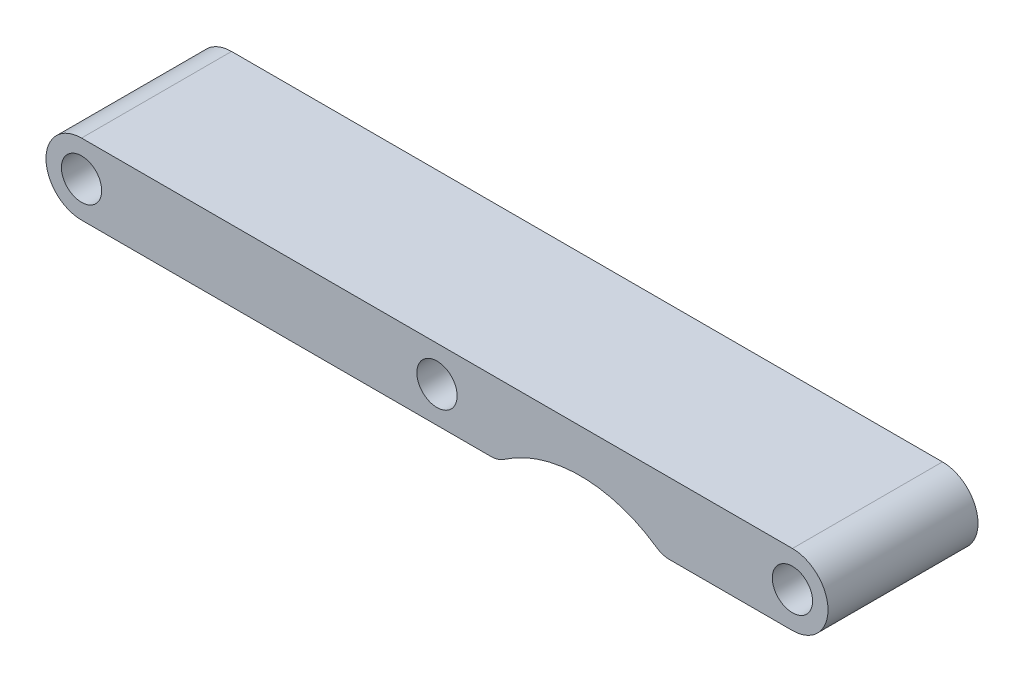
ISO-10303-21;
HEADER;
FILE_DESCRIPTION(('STEP AP214'),'2;1');
FILE_NAME('part.step','',(''),(''),'','','');
FILE_SCHEMA(('AUTOMOTIVE_DESIGN { 1 0 10303 214 1 1 1 1 }'));
ENDSEC;
DATA;
#1=APPLICATION_CONTEXT('core data for automotive mechanical design processes');
#2=APPLICATION_PROTOCOL_DEFINITION('international standard','automotive_design',2000,#1);
#3=PRODUCT_CONTEXT('',#1,'mechanical');
#4=PRODUCT('Part','Part','',(#3));
#5=PRODUCT_RELATED_PRODUCT_CATEGORY('part','',(#4));
#6=PRODUCT_DEFINITION_FORMATION('','',#4);
#7=PRODUCT_DEFINITION_CONTEXT('part definition',#1,'design');
#8=PRODUCT_DEFINITION('design','',#6,#7);
#9=PRODUCT_DEFINITION_SHAPE('','',#8);
#10=(LENGTH_UNIT() NAMED_UNIT(*) SI_UNIT(.MILLI.,.METRE.));
#11=(NAMED_UNIT(*) PLANE_ANGLE_UNIT() SI_UNIT($,.RADIAN.));
#12=(NAMED_UNIT(*) SI_UNIT($,.STERADIAN.) SOLID_ANGLE_UNIT());
#13=UNCERTAINTY_MEASURE_WITH_UNIT(LENGTH_MEASURE(1.E-05),#10,'distance_accuracy_value','');
#14=(GEOMETRIC_REPRESENTATION_CONTEXT(3) GLOBAL_UNCERTAINTY_ASSIGNED_CONTEXT((#13)) GLOBAL_UNIT_ASSIGNED_CONTEXT((#10,
#11,#12)) REPRESENTATION_CONTEXT('',''));
#15=CARTESIAN_POINT('',(0.,0.,0.));
#16=DIRECTION('',(0.,0.,1.));
#17=DIRECTION('',(1.,0.,0.));
#18=AXIS2_PLACEMENT_3D('',#15,#16,#17);
#19=CARTESIAN_POINT('',(76.2,3.81,16.0782));
#20=DIRECTION('',(0.,0.,-1.));
#21=DIRECTION('',(-1.,0.,0.));
#22=AXIS2_PLACEMENT_3D('',#19,#20,#21);
#23=PLANE('',#22);
#24=CARTESIAN_POINT('',(53.46050014,-11.28776,16.0782));
#25=DIRECTION('',(0.,0.,-1.));
#26=DIRECTION('',(-1.,0.,0.));
#27=AXIS2_PLACEMENT_3D('',#24,#25,#26);
#28=CIRCLE('',#27,14.2875);
#29=CARTESIAN_POINT('',(45.3185028545965,0.452790943396227,16.0782));
#30=VERTEX_POINT('',#29);
#31=CARTESIAN_POINT('',(61.6024974254035,0.452790943396231,16.0782));
#32=VERTEX_POINT('',#31);
#33=EDGE_CURVE('E143',#30,#32,#28,.T.);
#34=ORIENTED_EDGE('',*,*,#33,.T.);
#35=CARTESIAN_POINT('',(63.0499636094752,2.54,16.0782));
#36=DIRECTION('',(0.,0.,-1.));
#37=DIRECTION('',(-1.,0.,0.));
#38=AXIS2_PLACEMENT_3D('',#35,#36,#37);
#39=CIRCLE('',#38,2.54);
#40=CARTESIAN_POINT('',(63.0499636094752,0.,16.0782));
#41=VERTEX_POINT('',#40);
#42=EDGE_CURVE('E41',#32,#41,#39,.F.);
#43=ORIENTED_EDGE('',*,*,#42,.T.);
#44=DIRECTION('',(1.,0.,0.));
#45=VECTOR('',#44,1.);
#46=CARTESIAN_POINT('',(62.219445877496,0.,16.0782));
#47=LINE('',#46,#45);
#48=CARTESIAN_POINT('',(76.2,0.,16.0782));
#49=VERTEX_POINT('',#48);
#50=EDGE_CURVE('E116',#41,#49,#47,.T.);
#51=ORIENTED_EDGE('',*,*,#50,.T.);
#52=CARTESIAN_POINT('',(76.2,3.81,16.0782));
#53=DIRECTION('',(0.,0.,1.));
#54=DIRECTION('',(-1.,0.,0.));
#55=AXIS2_PLACEMENT_3D('',#52,#53,#54);
#56=CIRCLE('',#55,3.81);
#57=CARTESIAN_POINT('',(76.2,7.62000000000001,16.0782));
#58=VERTEX_POINT('',#57);
#59=EDGE_CURVE('E111',#49,#58,#56,.T.);
#60=ORIENTED_EDGE('',*,*,#59,.T.);
#61=DIRECTION('',(-1.,0.,0.));
#62=VECTOR('',#61,1.);
#63=CARTESIAN_POINT('',(0.,7.62,16.0782));
#64=LINE('',#63,#62);
#65=CARTESIAN_POINT('',(0.,7.62,16.0782));
#66=VERTEX_POINT('',#65);
#67=EDGE_CURVE('E100',#58,#66,#64,.T.);
#68=ORIENTED_EDGE('',*,*,#67,.T.);
#69=CARTESIAN_POINT('',(0.,3.81,16.0782));
#70=DIRECTION('',(0.,0.,1.));
#71=DIRECTION('',(1.,0.,0.));
#72=AXIS2_PLACEMENT_3D('',#69,#70,#71);
#73=CIRCLE('',#72,3.81);
#74=CARTESIAN_POINT('',(0.,0.,16.0782));
#75=VERTEX_POINT('',#74);
#76=EDGE_CURVE('E110',#66,#75,#73,.T.);
#77=ORIENTED_EDGE('',*,*,#76,.T.);
#78=DIRECTION('',(1.,0.,0.));
#79=VECTOR('',#78,1.);
#80=CARTESIAN_POINT('',(0.,0.,16.0782));
#81=LINE('',#80,#79);
#82=CARTESIAN_POINT('',(43.8710366705248,0.,16.0782));
#83=VERTEX_POINT('',#82);
#84=EDGE_CURVE('E170',#75,#83,#81,.T.);
#85=ORIENTED_EDGE('',*,*,#84,.T.);
#86=CARTESIAN_POINT('',(43.8710366705248,2.54,16.0782));
#87=DIRECTION('',(0.,0.,-1.));
#88=DIRECTION('',(-1.,0.,0.));
#89=AXIS2_PLACEMENT_3D('',#86,#87,#88);
#90=CIRCLE('',#89,2.54);
#91=EDGE_CURVE('E141',#83,#30,#90,.F.);
#92=ORIENTED_EDGE('',*,*,#91,.T.);
#93=EDGE_LOOP('',(#34,#43,#51,#60,#68,#77,#85,#92));
#94=FACE_BOUND('',#93,.T.);
#95=CARTESIAN_POINT('',(0.,3.81,16.0782));
#96=DIRECTION('',(0.,0.,1.));
#97=DIRECTION('',(1.,0.,0.));
#98=AXIS2_PLACEMENT_3D('',#95,#96,#97);
#99=CIRCLE('',#98,2.159);
#100=CARTESIAN_POINT('',(2.159,3.81,16.0782));
#101=VERTEX_POINT('',#100);
#102=EDGE_CURVE('E181',#101,#101,#99,.T.);
#103=ORIENTED_EDGE('',*,*,#102,.F.);
#104=EDGE_LOOP('',(#103));
#105=FACE_BOUND('',#104,.T.);
#106=CARTESIAN_POINT('',(38.1,3.81,16.0782));
#107=DIRECTION('',(0.,0.,1.));
#108=DIRECTION('',(1.,0.,0.));
#109=AXIS2_PLACEMENT_3D('',#106,#107,#108);
#110=CIRCLE('',#109,2.159);
#111=CARTESIAN_POINT('',(40.259,3.81,16.0782));
#112=VERTEX_POINT('',#111);
#113=EDGE_CURVE('E187',#112,#112,#110,.T.);
#114=ORIENTED_EDGE('',*,*,#113,.F.);
#115=EDGE_LOOP('',(#114));
#116=FACE_BOUND('',#115,.T.);
#117=CARTESIAN_POINT('',(76.2,3.81,16.0782));
#118=DIRECTION('',(0.,0.,1.));
#119=DIRECTION('',(1.,0.,0.));
#120=AXIS2_PLACEMENT_3D('',#117,#118,#119);
#121=CIRCLE('',#120,2.15899999999999);
#122=CARTESIAN_POINT('',(78.359,3.81,16.0782));
#123=VERTEX_POINT('',#122);
#124=EDGE_CURVE('E193',#123,#123,#121,.T.);
#125=ORIENTED_EDGE('',*,*,#124,.F.);
#126=EDGE_LOOP('',(#125));
#127=FACE_BOUND('',#126,.T.);
#128=ADVANCED_FACE('F33',(#94,#105,#116,#127),#23,.F.);
#129=CARTESIAN_POINT('',(76.2,3.81,0.));
#130=DIRECTION('',(0.,0.,-1.));
#131=DIRECTION('',(-1.,0.,0.));
#132=AXIS2_PLACEMENT_3D('',#129,#130,#131);
#133=PLANE('',#132);
#134=CARTESIAN_POINT('',(38.1,3.81,0.));
#135=DIRECTION('',(0.,0.,1.));
#136=DIRECTION('',(1.,0.,0.));
#137=AXIS2_PLACEMENT_3D('',#134,#135,#136);
#138=CIRCLE('',#137,2.159);
#139=CARTESIAN_POINT('',(40.259,3.81,0.));
#140=VERTEX_POINT('',#139);
#141=EDGE_CURVE('E190',#140,#140,#138,.T.);
#142=ORIENTED_EDGE('',*,*,#141,.T.);
#143=EDGE_LOOP('',(#142));
#144=FACE_BOUND('',#143,.T.);
#145=DIRECTION('',(1.,0.,0.));
#146=VECTOR('',#145,1.);
#147=CARTESIAN_POINT('',(62.219445877496,0.,0.));
#148=LINE('',#147,#146);
#149=CARTESIAN_POINT('',(63.0499636094752,0.,0.));
#150=VERTEX_POINT('',#149);
#151=CARTESIAN_POINT('',(76.2,0.,0.));
#152=VERTEX_POINT('',#151);
#153=EDGE_CURVE('E120',#150,#152,#148,.T.);
#154=ORIENTED_EDGE('',*,*,#153,.F.);
#155=CARTESIAN_POINT('',(63.0499636094752,2.54,0.));
#156=DIRECTION('',(0.,0.,-1.));
#157=DIRECTION('',(-1.,0.,0.));
#158=AXIS2_PLACEMENT_3D('',#155,#156,#157);
#159=CIRCLE('',#158,2.54);
#160=CARTESIAN_POINT('',(61.6024974254035,0.452790943396231,0.));
#161=VERTEX_POINT('',#160);
#162=EDGE_CURVE('E135',#150,#161,#159,.T.);
#163=ORIENTED_EDGE('',*,*,#162,.T.);
#164=CARTESIAN_POINT('',(53.46050014,-11.28776,0.));
#165=DIRECTION('',(0.,0.,-1.));
#166=DIRECTION('',(-1.,0.,0.));
#167=AXIS2_PLACEMENT_3D('',#164,#165,#166);
#168=CIRCLE('',#167,14.2875);
#169=CARTESIAN_POINT('',(45.3185028545965,0.452790943396227,0.));
#170=VERTEX_POINT('',#169);
#171=EDGE_CURVE('E156',#170,#161,#168,.T.);
#172=ORIENTED_EDGE('',*,*,#171,.F.);
#173=CARTESIAN_POINT('',(43.8710366705248,2.54,0.));
#174=DIRECTION('',(0.,0.,-1.));
#175=DIRECTION('',(-1.,0.,0.));
#176=AXIS2_PLACEMENT_3D('',#173,#174,#175);
#177=CIRCLE('',#176,2.54);
#178=CARTESIAN_POINT('',(43.8710366705248,0.,0.));
#179=VERTEX_POINT('',#178);
#180=EDGE_CURVE('E128',#170,#179,#177,.T.);
#181=ORIENTED_EDGE('',*,*,#180,.T.);
#182=DIRECTION('',(1.,0.,0.));
#183=VECTOR('',#182,1.);
#184=CARTESIAN_POINT('',(0.,0.,0.));
#185=LINE('',#184,#183);
#186=CARTESIAN_POINT('',(0.,0.,0.));
#187=VERTEX_POINT('',#186);
#188=EDGE_CURVE('E159',#187,#179,#185,.T.);
#189=ORIENTED_EDGE('',*,*,#188,.F.);
#190=CARTESIAN_POINT('',(0.,3.81,0.));
#191=DIRECTION('',(0.,0.,1.));
#192=DIRECTION('',(1.,0.,0.));
#193=AXIS2_PLACEMENT_3D('',#190,#191,#192);
#194=CIRCLE('',#193,3.81);
#195=CARTESIAN_POINT('',(0.,7.62,0.));
#196=VERTEX_POINT('',#195);
#197=EDGE_CURVE('E162',#196,#187,#194,.T.);
#198=ORIENTED_EDGE('',*,*,#197,.F.);
#199=DIRECTION('',(-1.,0.,0.));
#200=VECTOR('',#199,1.);
#201=CARTESIAN_POINT('',(0.,7.62,0.));
#202=LINE('',#201,#200);
#203=CARTESIAN_POINT('',(76.2,7.62000000000001,0.));
#204=VERTEX_POINT('',#203);
#205=EDGE_CURVE('E180',#204,#196,#202,.T.);
#206=ORIENTED_EDGE('',*,*,#205,.F.);
#207=CARTESIAN_POINT('',(76.2,3.81,0.));
#208=DIRECTION('',(0.,0.,1.));
#209=DIRECTION('',(-1.,0.,0.));
#210=AXIS2_PLACEMENT_3D('',#207,#208,#209);
#211=CIRCLE('',#210,3.81);
#212=EDGE_CURVE('E124',#152,#204,#211,.T.);
#213=ORIENTED_EDGE('',*,*,#212,.F.);
#214=EDGE_LOOP('',(#154,#163,#172,#181,#189,#198,#206,#213));
#215=FACE_BOUND('',#214,.T.);
#216=CARTESIAN_POINT('',(0.,3.81,0.));
#217=DIRECTION('',(0.,0.,1.));
#218=DIRECTION('',(1.,0.,0.));
#219=AXIS2_PLACEMENT_3D('',#216,#217,#218);
#220=CIRCLE('',#219,2.159);
#221=CARTESIAN_POINT('',(2.159,3.81,0.));
#222=VERTEX_POINT('',#221);
#223=EDGE_CURVE('E184',#222,#222,#220,.T.);
#224=ORIENTED_EDGE('',*,*,#223,.T.);
#225=EDGE_LOOP('',(#224));
#226=FACE_BOUND('',#225,.T.);
#227=CARTESIAN_POINT('',(76.2,3.81,0.));
#228=DIRECTION('',(0.,0.,1.));
#229=DIRECTION('',(1.,0.,0.));
#230=AXIS2_PLACEMENT_3D('',#227,#228,#229);
#231=CIRCLE('',#230,2.15899999999999);
#232=CARTESIAN_POINT('',(78.359,3.81,0.));
#233=VERTEX_POINT('',#232);
#234=EDGE_CURVE('E196',#233,#233,#231,.T.);
#235=ORIENTED_EDGE('',*,*,#234,.T.);
#236=EDGE_LOOP('',(#235));
#237=FACE_BOUND('',#236,.T.);
#238=ADVANCED_FACE('F154',(#144,#215,#226,#237),#133,.T.);
#239=CARTESIAN_POINT('',(76.2,3.81,16.0782));
#240=DIRECTION('',(0.,0.,-1.));
#241=DIRECTION('',(-1.,0.,0.));
#242=AXIS2_PLACEMENT_3D('',#239,#240,#241);
#243=CYLINDRICAL_SURFACE('',#242,3.81);
#244=ORIENTED_EDGE('',*,*,#212,.T.);
#245=DIRECTION('',(0.,0.,-1.));
#246=VECTOR('',#245,1.);
#247=CARTESIAN_POINT('',(76.2,7.62000000000001,16.0782));
#248=LINE('',#247,#246);
#249=EDGE_CURVE('E104',#58,#204,#248,.T.);
#250=ORIENTED_EDGE('',*,*,#249,.F.);
#251=ORIENTED_EDGE('',*,*,#59,.F.);
#252=DIRECTION('',(0.,0.,-1.));
#253=VECTOR('',#252,1.);
#254=CARTESIAN_POINT('',(76.2,0.,16.0782));
#255=LINE('',#254,#253);
#256=EDGE_CURVE('E149',#49,#152,#255,.T.);
#257=ORIENTED_EDGE('',*,*,#256,.T.);
#258=EDGE_LOOP('',(#244,#250,#251,#257));
#259=FACE_BOUND('',#258,.T.);
#260=ADVANCED_FACE('F122',(#259),#243,.T.);
#261=CARTESIAN_POINT('',(0.,7.62,16.0782));
#262=DIRECTION('',(0.,-1.,0.));
#263=DIRECTION('',(1.,0.,0.));
#264=AXIS2_PLACEMENT_3D('',#261,#262,#263);
#265=PLANE('',#264);
#266=ORIENTED_EDGE('',*,*,#205,.T.);
#267=DIRECTION('',(0.,0.,-1.));
#268=VECTOR('',#267,1.);
#269=CARTESIAN_POINT('',(0.,7.62,16.0782));
#270=LINE('',#269,#268);
#271=EDGE_CURVE('E107',#66,#196,#270,.T.);
#272=ORIENTED_EDGE('',*,*,#271,.F.);
#273=ORIENTED_EDGE('',*,*,#67,.F.);
#274=ORIENTED_EDGE('',*,*,#249,.T.);
#275=EDGE_LOOP('',(#266,#272,#273,#274));
#276=FACE_BOUND('',#275,.T.);
#277=ADVANCED_FACE('F102',(#276),#265,.F.);
#278=CARTESIAN_POINT('',(0.,3.81,16.0782));
#279=DIRECTION('',(0.,0.,-1.));
#280=DIRECTION('',(-1.,0.,0.));
#281=AXIS2_PLACEMENT_3D('',#278,#279,#280);
#282=CYLINDRICAL_SURFACE('',#281,3.81);
#283=ORIENTED_EDGE('',*,*,#197,.T.);
#284=DIRECTION('',(0.,0.,-1.));
#285=VECTOR('',#284,1.);
#286=CARTESIAN_POINT('',(0.,0.,16.0782));
#287=LINE('',#286,#285);
#288=EDGE_CURVE('E130',#75,#187,#287,.T.);
#289=ORIENTED_EDGE('',*,*,#288,.F.);
#290=ORIENTED_EDGE('',*,*,#76,.F.);
#291=ORIENTED_EDGE('',*,*,#271,.T.);
#292=EDGE_LOOP('',(#283,#289,#290,#291));
#293=FACE_BOUND('',#292,.T.);
#294=ADVANCED_FACE('F182',(#293),#282,.T.);
#295=CARTESIAN_POINT('',(0.,0.,16.0782));
#296=DIRECTION('',(0.,1.,0.));
#297=DIRECTION('',(0.,0.,1.));
#298=AXIS2_PLACEMENT_3D('',#295,#296,#297);
#299=PLANE('',#298);
#300=ORIENTED_EDGE('',*,*,#188,.T.);
#301=DIRECTION('',(0.,0.,-1.));
#302=VECTOR('',#301,1.);
#303=CARTESIAN_POINT('',(43.8710366705248,0.,16.0782));
#304=LINE('',#303,#302);
#305=EDGE_CURVE('E11',#179,#83,#304,.F.);
#306=ORIENTED_EDGE('',*,*,#305,.T.);
#307=ORIENTED_EDGE('',*,*,#84,.F.);
#308=ORIENTED_EDGE('',*,*,#288,.T.);
#309=EDGE_LOOP('',(#300,#306,#307,#308));
#310=FACE_BOUND('',#309,.T.);
#311=ADVANCED_FACE('F169',(#310),#299,.F.);
#312=CARTESIAN_POINT('',(53.46050014,-11.28776,16.0782));
#313=DIRECTION('',(0.,0.,-1.));
#314=DIRECTION('',(-1.,0.,0.));
#315=AXIS2_PLACEMENT_3D('',#312,#313,#314);
#316=CYLINDRICAL_SURFACE('',#315,14.2875);
#317=ORIENTED_EDGE('',*,*,#171,.T.);
#318=DIRECTION('',(0.,0.,-1.));
#319=VECTOR('',#318,1.);
#320=CARTESIAN_POINT('',(61.6024974254035,0.452790943396232,16.0782));
#321=LINE('',#320,#319);
#322=EDGE_CURVE('E54',#161,#32,#321,.F.);
#323=ORIENTED_EDGE('',*,*,#322,.T.);
#324=ORIENTED_EDGE('',*,*,#33,.F.);
#325=DIRECTION('',(0.,0.,-1.));
#326=VECTOR('',#325,1.);
#327=CARTESIAN_POINT('',(45.3185028545965,0.452790943396227,16.0782));
#328=LINE('',#327,#326);
#329=EDGE_CURVE('E137',#30,#170,#328,.T.);
#330=ORIENTED_EDGE('',*,*,#329,.T.);
#331=EDGE_LOOP('',(#317,#323,#324,#330));
#332=FACE_BOUND('',#331,.T.);
#333=ADVANCED_FACE('F157',(#332),#316,.F.);
#334=CARTESIAN_POINT('',(62.219445877496,0.,16.0782));
#335=DIRECTION('',(0.,1.,0.));
#336=DIRECTION('',(0.,0.,1.));
#337=AXIS2_PLACEMENT_3D('',#334,#335,#336);
#338=PLANE('',#337);
#339=ORIENTED_EDGE('',*,*,#50,.F.);
#340=DIRECTION('',(0.,0.,-1.));
#341=VECTOR('',#340,1.);
#342=CARTESIAN_POINT('',(63.0499636094752,0.,16.0782));
#343=LINE('',#342,#341);
#344=EDGE_CURVE('E125',#41,#150,#343,.T.);
#345=ORIENTED_EDGE('',*,*,#344,.T.);
#346=ORIENTED_EDGE('',*,*,#153,.T.);
#347=ORIENTED_EDGE('',*,*,#256,.F.);
#348=EDGE_LOOP('',(#339,#345,#346,#347));
#349=FACE_BOUND('',#348,.T.);
#350=ADVANCED_FACE('F147',(#349),#338,.F.);
#351=CARTESIAN_POINT('',(0.,3.81,16.0782));
#352=DIRECTION('',(0.,0.,-1.));
#353=DIRECTION('',(-1.,0.,0.));
#354=AXIS2_PLACEMENT_3D('',#351,#352,#353);
#355=CYLINDRICAL_SURFACE('',#354,2.159);
#356=ORIENTED_EDGE('',*,*,#102,.T.);
#357=EDGE_LOOP('',(#356));
#358=FACE_BOUND('',#357,.T.);
#359=ORIENTED_EDGE('',*,*,#223,.F.);
#360=EDGE_LOOP('',(#359));
#361=FACE_BOUND('',#360,.T.);
#362=ADVANCED_FACE('F213',(#358,#361),#355,.F.);
#363=CARTESIAN_POINT('',(38.1,3.81,16.0782));
#364=DIRECTION('',(0.,0.,-1.));
#365=DIRECTION('',(-1.,0.,0.));
#366=AXIS2_PLACEMENT_3D('',#363,#364,#365);
#367=CYLINDRICAL_SURFACE('',#366,2.159);
#368=ORIENTED_EDGE('',*,*,#113,.T.);
#369=EDGE_LOOP('',(#368));
#370=FACE_BOUND('',#369,.T.);
#371=ORIENTED_EDGE('',*,*,#141,.F.);
#372=EDGE_LOOP('',(#371));
#373=FACE_BOUND('',#372,.T.);
#374=ADVANCED_FACE('F232',(#370,#373),#367,.F.);
#375=CARTESIAN_POINT('',(76.2,3.81,16.0782));
#376=DIRECTION('',(0.,0.,-1.));
#377=DIRECTION('',(-1.,0.,0.));
#378=AXIS2_PLACEMENT_3D('',#375,#376,#377);
#379=CYLINDRICAL_SURFACE('',#378,2.15899999999999);
#380=ORIENTED_EDGE('',*,*,#124,.T.);
#381=EDGE_LOOP('',(#380));
#382=FACE_BOUND('',#381,.T.);
#383=ORIENTED_EDGE('',*,*,#234,.F.);
#384=EDGE_LOOP('',(#383));
#385=FACE_BOUND('',#384,.T.);
#386=ADVANCED_FACE('F202',(#382,#385),#379,.F.);
#387=CARTESIAN_POINT('',(63.0499636094752,2.54,16.0782));
#388=DIRECTION('',(0.,0.,-1.));
#389=DIRECTION('',(-1.,0.,0.));
#390=AXIS2_PLACEMENT_3D('',#387,#388,#389);
#391=CYLINDRICAL_SURFACE('',#390,2.54);
#392=ORIENTED_EDGE('',*,*,#42,.F.);
#393=ORIENTED_EDGE('',*,*,#322,.F.);
#394=ORIENTED_EDGE('',*,*,#162,.F.);
#395=ORIENTED_EDGE('',*,*,#344,.F.);
#396=EDGE_LOOP('',(#392,#393,#394,#395));
#397=FACE_BOUND('',#396,.T.);
#398=ADVANCED_FACE('F151',(#397),#391,.T.);
#399=CARTESIAN_POINT('',(43.8710366705248,2.54,16.0782));
#400=DIRECTION('',(0.,0.,-1.));
#401=DIRECTION('',(-1.,0.,0.));
#402=AXIS2_PLACEMENT_3D('',#399,#400,#401);
#403=CYLINDRICAL_SURFACE('',#402,2.54);
#404=ORIENTED_EDGE('',*,*,#91,.F.);
#405=ORIENTED_EDGE('',*,*,#305,.F.);
#406=ORIENTED_EDGE('',*,*,#180,.F.);
#407=ORIENTED_EDGE('',*,*,#329,.F.);
#408=EDGE_LOOP('',(#404,#405,#406,#407));
#409=FACE_BOUND('',#408,.T.);
#410=ADVANCED_FACE('F35',(#409),#403,.T.);
#411=CLOSED_SHELL('',(#128,#238,#260,#277,#294,#311,#333,#350,#362,#374,#386,#398,#410));
#412=MANIFOLD_SOLID_BREP('B2',#411);
#413=ADVANCED_BREP_SHAPE_REPRESENTATION('',(#18,#412),#14);
#414=SHAPE_DEFINITION_REPRESENTATION(#9,#413);
ENDSEC;
END-ISO-10303-21;
